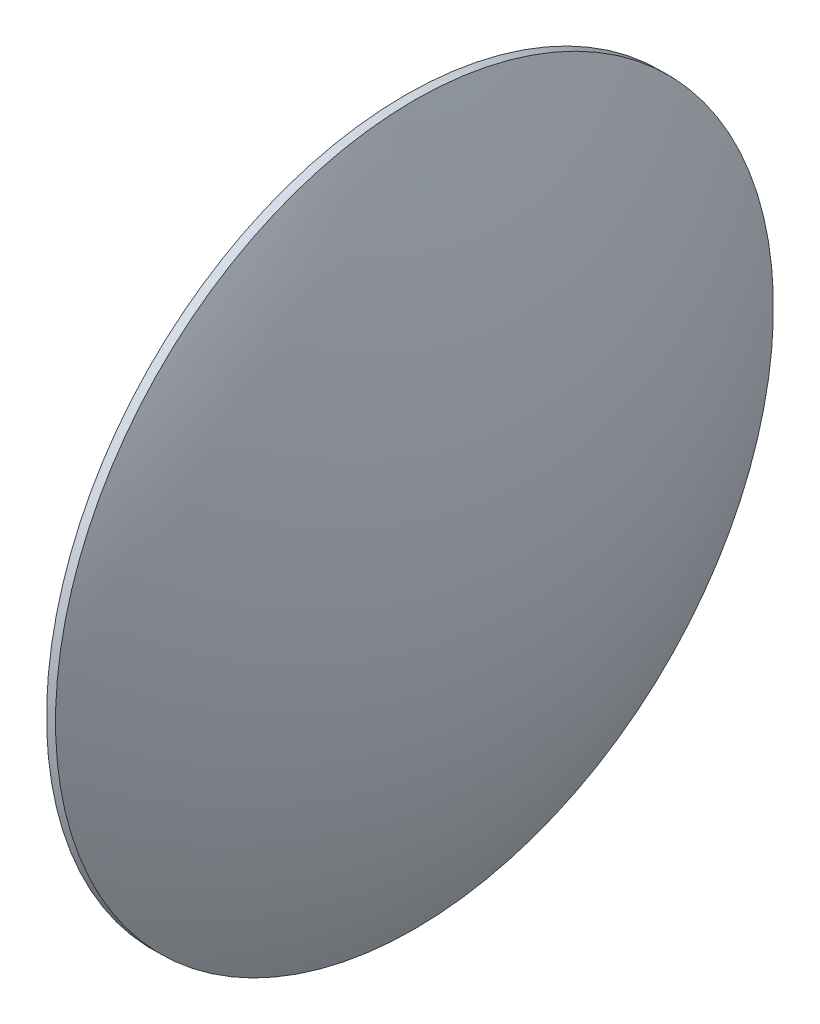
ISO-10303-21;
HEADER;
FILE_DESCRIPTION(('STEP AP214'),'2;1');
FILE_NAME('part.step','',(''),(''),'','','');
FILE_SCHEMA(('AUTOMOTIVE_DESIGN { 1 0 10303 214 1 1 1 1 }'));
ENDSEC;
DATA;
#1=APPLICATION_CONTEXT('core data for automotive mechanical design processes');
#2=APPLICATION_PROTOCOL_DEFINITION('international standard','automotive_design',2000,#1);
#3=PRODUCT_CONTEXT('',#1,'mechanical');
#4=PRODUCT('Part','Part','',(#3));
#5=PRODUCT_RELATED_PRODUCT_CATEGORY('part','',(#4));
#6=PRODUCT_DEFINITION_FORMATION('','',#4);
#7=PRODUCT_DEFINITION_CONTEXT('part definition',#1,'design');
#8=PRODUCT_DEFINITION('design','',#6,#7);
#9=PRODUCT_DEFINITION_SHAPE('','',#8);
#10=(LENGTH_UNIT() NAMED_UNIT(*) SI_UNIT(.MILLI.,.METRE.));
#11=(NAMED_UNIT(*) PLANE_ANGLE_UNIT() SI_UNIT($,.RADIAN.));
#12=(NAMED_UNIT(*) SI_UNIT($,.STERADIAN.) SOLID_ANGLE_UNIT());
#13=UNCERTAINTY_MEASURE_WITH_UNIT(LENGTH_MEASURE(1.E-05),#10,'distance_accuracy_value','');
#14=(GEOMETRIC_REPRESENTATION_CONTEXT(3) GLOBAL_UNCERTAINTY_ASSIGNED_CONTEXT((#13)) GLOBAL_UNIT_ASSIGNED_CONTEXT((#10,
#11,#12)) REPRESENTATION_CONTEXT('',''));
#15=CARTESIAN_POINT('',(0.,0.,0.));
#16=DIRECTION('',(0.,0.,1.));
#17=DIRECTION('',(1.,0.,0.));
#18=AXIS2_PLACEMENT_3D('',#15,#16,#17);
#19=CARTESIAN_POINT('',(61.5162369007218,0.,0.));
#20=DIRECTION('',(-1.,0.,0.));
#21=DIRECTION('',(0.,1.,0.));
#22=AXIS2_PLACEMENT_3D('',#19,#20,#21);
#23=SPHERICAL_SURFACE('',#22,35.);
#24=CARTESIAN_POINT('',(30.1654720931298,0.,0.));
#25=DIRECTION('',(-1.,0.,0.));
#26=DIRECTION('',(0.,-1.,0.));
#27=AXIS2_PLACEMENT_3D('',#24,#25,#26);
#28=CIRCLE('',#27,15.5605123944894);
#29=CARTESIAN_POINT('',(30.1654720931298,-15.5605123944894,0.));
#30=VERTEX_POINT('',#29);
#31=EDGE_CURVE('E37',#30,#30,#28,.T.);
#32=ORIENTED_EDGE('',*,*,#31,.T.);
#33=EDGE_LOOP('',(#32));
#34=FACE_BOUND('',#33,.T.);
#35=ADVANCED_FACE('F31',(#34),#23,.T.);
#36=CARTESIAN_POINT('',(-0.797438488718771,0.,0.));
#37=DIRECTION('',(-1.,0.,0.));
#38=DIRECTION('',(0.,1.,0.));
#39=AXIS2_PLACEMENT_3D('',#36,#37,#38);
#40=SPHERICAL_SURFACE('',#39,35.);
#41=CARTESIAN_POINT('',(30.5533263188731,0.,0.));
#42=DIRECTION('',(-1.,0.,0.));
#43=DIRECTION('',(0.,-1.,0.));
#44=AXIS2_PLACEMENT_3D('',#41,#42,#43);
#45=CIRCLE('',#44,15.5605123944894);
#46=CARTESIAN_POINT('',(30.5533263188731,-15.5605123944894,0.));
#47=VERTEX_POINT('',#46);
#48=EDGE_CURVE('E10',#47,#47,#45,.T.);
#49=ORIENTED_EDGE('',*,*,#48,.F.);
#50=EDGE_LOOP('',(#49));
#51=FACE_BOUND('',#50,.T.);
#52=ADVANCED_FACE('F46',(#51),#40,.T.);
#53=CARTESIAN_POINT('',(26.5162369007218,0.,0.));
#54=DIRECTION('',(-1.,0.,0.));
#55=DIRECTION('',(0.,-1.,0.));
#56=AXIS2_PLACEMENT_3D('',#53,#54,#55);
#57=CYLINDRICAL_SURFACE('',#56,15.5605123944894);
#58=ORIENTED_EDGE('',*,*,#31,.F.);
#59=EDGE_LOOP('',(#58));
#60=FACE_BOUND('',#59,.T.);
#61=ORIENTED_EDGE('',*,*,#48,.T.);
#62=EDGE_LOOP('',(#61));
#63=FACE_BOUND('',#62,.T.);
#64=ADVANCED_FACE('F44',(#60,#63),#57,.T.);
#65=CLOSED_SHELL('',(#35,#52,#64));
#66=MANIFOLD_SOLID_BREP('B2',#65);
#67=ADVANCED_BREP_SHAPE_REPRESENTATION('',(#18,#66),#14);
#68=SHAPE_DEFINITION_REPRESENTATION(#9,#67);
ENDSEC;
END-ISO-10303-21;
